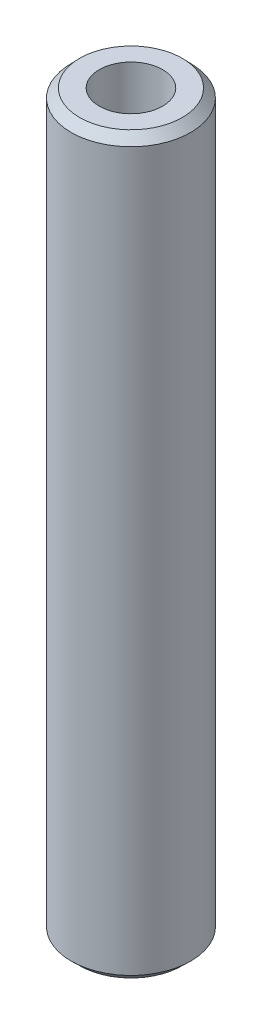
ISO-10303-21;
HEADER;
FILE_DESCRIPTION(('STEP AP214'),'2;1');
FILE_NAME('part.step','',(''),(''),'','','');
FILE_SCHEMA(('AUTOMOTIVE_DESIGN { 1 0 10303 214 1 1 1 1 }'));
ENDSEC;
DATA;
#1=APPLICATION_CONTEXT('core data for automotive mechanical design processes');
#2=APPLICATION_PROTOCOL_DEFINITION('international standard','automotive_design',2000,#1);
#3=PRODUCT_CONTEXT('',#1,'mechanical');
#4=PRODUCT('Part','Part','',(#3));
#5=PRODUCT_RELATED_PRODUCT_CATEGORY('part','',(#4));
#6=PRODUCT_DEFINITION_FORMATION('','',#4);
#7=PRODUCT_DEFINITION_CONTEXT('part definition',#1,'design');
#8=PRODUCT_DEFINITION('design','',#6,#7);
#9=PRODUCT_DEFINITION_SHAPE('','',#8);
#10=(LENGTH_UNIT() NAMED_UNIT(*) SI_UNIT(.MILLI.,.METRE.));
#11=(NAMED_UNIT(*) PLANE_ANGLE_UNIT() SI_UNIT($,.RADIAN.));
#12=(NAMED_UNIT(*) SI_UNIT($,.STERADIAN.) SOLID_ANGLE_UNIT());
#13=UNCERTAINTY_MEASURE_WITH_UNIT(LENGTH_MEASURE(1.E-05),#10,'distance_accuracy_value','');
#14=(GEOMETRIC_REPRESENTATION_CONTEXT(3) GLOBAL_UNCERTAINTY_ASSIGNED_CONTEXT((#13)) GLOBAL_UNIT_ASSIGNED_CONTEXT((#10,
#11,#12)) REPRESENTATION_CONTEXT('',''));
#15=CARTESIAN_POINT('',(0.,0.,0.));
#16=DIRECTION('',(0.,0.,1.));
#17=DIRECTION('',(1.,0.,0.));
#18=AXIS2_PLACEMENT_3D('',#15,#16,#17);
#19=CARTESIAN_POINT('',(0.,92.2419853872136,0.));
#20=DIRECTION('',(0.,-1.,0.));
#21=DIRECTION('',(0.,0.,-1.));
#22=AXIS2_PLACEMENT_3D('',#19,#20,#21);
#23=CYLINDRICAL_SURFACE('',#22,7.5);
#24=CARTESIAN_POINT('',(0.,91.1445665505597,0.));
#25=DIRECTION('',(0.,1.,0.));
#26=DIRECTION('',(0.,0.,1.));
#27=AXIS2_PLACEMENT_3D('',#24,#25,#26);
#28=CIRCLE('',#27,7.5);
#29=CARTESIAN_POINT('',(0.,91.1445665505597,7.5));
#30=VERTEX_POINT('',#29);
#31=EDGE_CURVE('E50',#30,#30,#28,.F.);
#32=ORIENTED_EDGE('',*,*,#31,.T.);
#33=EDGE_LOOP('',(#32));
#34=FACE_BOUND('',#33,.T.);
#35=CARTESIAN_POINT('',(0.,1.0567542537767,0.));
#36=DIRECTION('',(0.,1.,0.));
#37=DIRECTION('',(0.,0.,1.));
#38=AXIS2_PLACEMENT_3D('',#35,#36,#37);
#39=CIRCLE('',#38,7.5);
#40=CARTESIAN_POINT('',(0.,1.0567542537767,7.5));
#41=VERTEX_POINT('',#40);
#42=EDGE_CURVE('E51',#41,#41,#39,.T.);
#43=ORIENTED_EDGE('',*,*,#42,.T.);
#44=EDGE_LOOP('',(#43));
#45=FACE_BOUND('',#44,.T.);
#46=ADVANCED_FACE('F39',(#34,#45),#23,.T.);
#47=CARTESIAN_POINT('',(0.,92.2419853872136,0.));
#48=DIRECTION('',(0.,1.,0.));
#49=DIRECTION('',(0.,0.,1.));
#50=AXIS2_PLACEMENT_3D('',#47,#48,#49);
#51=PLANE('',#50);
#52=CARTESIAN_POINT('',(0.,92.2419853872136,0.));
#53=DIRECTION('',(0.,1.,0.));
#54=DIRECTION('',(0.,0.,1.));
#55=AXIS2_PLACEMENT_3D('',#52,#53,#54);
#56=CIRCLE('',#55,6.44324574622329);
#57=CARTESIAN_POINT('',(0.,92.2419853872136,6.44324574622329));
#58=VERTEX_POINT('',#57);
#59=EDGE_CURVE('E54',#58,#58,#56,.T.);
#60=ORIENTED_EDGE('',*,*,#59,.T.);
#61=EDGE_LOOP('',(#60));
#62=FACE_BOUND('',#61,.T.);
#63=CARTESIAN_POINT('',(0.,92.2419853872136,0.));
#64=DIRECTION('',(0.,1.,0.));
#65=DIRECTION('',(0.,0.,1.));
#66=AXIS2_PLACEMENT_3D('',#63,#64,#65);
#67=CIRCLE('',#66,3.97905826610083);
#68=CARTESIAN_POINT('',(0.,92.2419853872136,3.97905826610083));
#69=VERTEX_POINT('',#68);
#70=EDGE_CURVE('E58',#69,#69,#67,.T.);
#71=ORIENTED_EDGE('',*,*,#70,.F.);
#72=EDGE_LOOP('',(#71));
#73=FACE_BOUND('',#72,.T.);
#74=ADVANCED_FACE('F69',(#62,#73),#51,.T.);
#75=CARTESIAN_POINT('',(0.,0.,0.));
#76=DIRECTION('',(0.,1.,0.));
#77=DIRECTION('',(0.,0.,1.));
#78=AXIS2_PLACEMENT_3D('',#75,#76,#77);
#79=PLANE('',#78);
#80=CARTESIAN_POINT('',(0.,0.,0.));
#81=DIRECTION('',(0.,1.,0.));
#82=DIRECTION('',(0.,0.,1.));
#83=AXIS2_PLACEMENT_3D('',#80,#81,#82);
#84=CIRCLE('',#83,6.40258116334618);
#85=CARTESIAN_POINT('',(0.,0.,6.40258116334618));
#86=VERTEX_POINT('',#85);
#87=EDGE_CURVE('E10',#86,#86,#84,.F.);
#88=ORIENTED_EDGE('',*,*,#87,.T.);
#89=EDGE_LOOP('',(#88));
#90=FACE_BOUND('',#89,.T.);
#91=CARTESIAN_POINT('',(0.,0.,0.));
#92=DIRECTION('',(0.,1.,0.));
#93=DIRECTION('',(0.,0.,1.));
#94=AXIS2_PLACEMENT_3D('',#91,#92,#93);
#95=CIRCLE('',#94,3.97905826610083);
#96=CARTESIAN_POINT('',(0.,0.,3.97905826610083));
#97=VERTEX_POINT('',#96);
#98=EDGE_CURVE('E63',#97,#97,#95,.T.);
#99=ORIENTED_EDGE('',*,*,#98,.T.);
#100=EDGE_LOOP('',(#99));
#101=FACE_BOUND('',#100,.T.);
#102=ADVANCED_FACE('F75',(#90,#101),#79,.F.);
#103=CARTESIAN_POINT('',(0.,92.2419853872136,0.));
#104=DIRECTION('',(0.,-1.,0.));
#105=DIRECTION('',(0.,0.,-1.));
#106=AXIS2_PLACEMENT_3D('',#103,#104,#105);
#107=CYLINDRICAL_SURFACE('',#106,3.97905826610083);
#108=ORIENTED_EDGE('',*,*,#70,.T.);
#109=EDGE_LOOP('',(#108));
#110=FACE_BOUND('',#109,.T.);
#111=ORIENTED_EDGE('',*,*,#98,.F.);
#112=EDGE_LOOP('',(#111));
#113=FACE_BOUND('',#112,.T.);
#114=ADVANCED_FACE('F70',(#110,#113),#107,.F.);
#115=CARTESIAN_POINT('',(0.,92.2419853872136,0.));
#116=DIRECTION('',(0.,-1.,0.));
#117=DIRECTION('',(0.,0.,-1.));
#118=AXIS2_PLACEMENT_3D('',#115,#116,#117);
#119=CONICAL_SURFACE('',#118,6.44324574622329,0.766523285666126);
#120=ORIENTED_EDGE('',*,*,#31,.F.);
#121=EDGE_LOOP('',(#120));
#122=FACE_BOUND('',#121,.T.);
#123=ORIENTED_EDGE('',*,*,#59,.F.);
#124=EDGE_LOOP('',(#123));
#125=FACE_BOUND('',#124,.T.);
#126=ADVANCED_FACE('F81',(#122,#125),#119,.T.);
#127=CARTESIAN_POINT('',(0.,1.0567542537767,0.));
#128=DIRECTION('',(0.,1.,0.));
#129=DIRECTION('',(0.,0.,1.));
#130=AXIS2_PLACEMENT_3D('',#127,#128,#129);
#131=CONICAL_SURFACE('',#130,7.5,0.804273041128767);
#132=ORIENTED_EDGE('',*,*,#87,.F.);
#133=EDGE_LOOP('',(#132));
#134=FACE_BOUND('',#133,.T.);
#135=ORIENTED_EDGE('',*,*,#42,.F.);
#136=EDGE_LOOP('',(#135));
#137=FACE_BOUND('',#136,.T.);
#138=ADVANCED_FACE('F45',(#134,#137),#131,.T.);
#139=CLOSED_SHELL('',(#46,#74,#102,#114,#126,#138));
#140=MANIFOLD_SOLID_BREP('B2',#139);
#141=ADVANCED_BREP_SHAPE_REPRESENTATION('',(#18,#140),#14);
#142=SHAPE_DEFINITION_REPRESENTATION(#9,#141);
ENDSEC;
END-ISO-10303-21;
